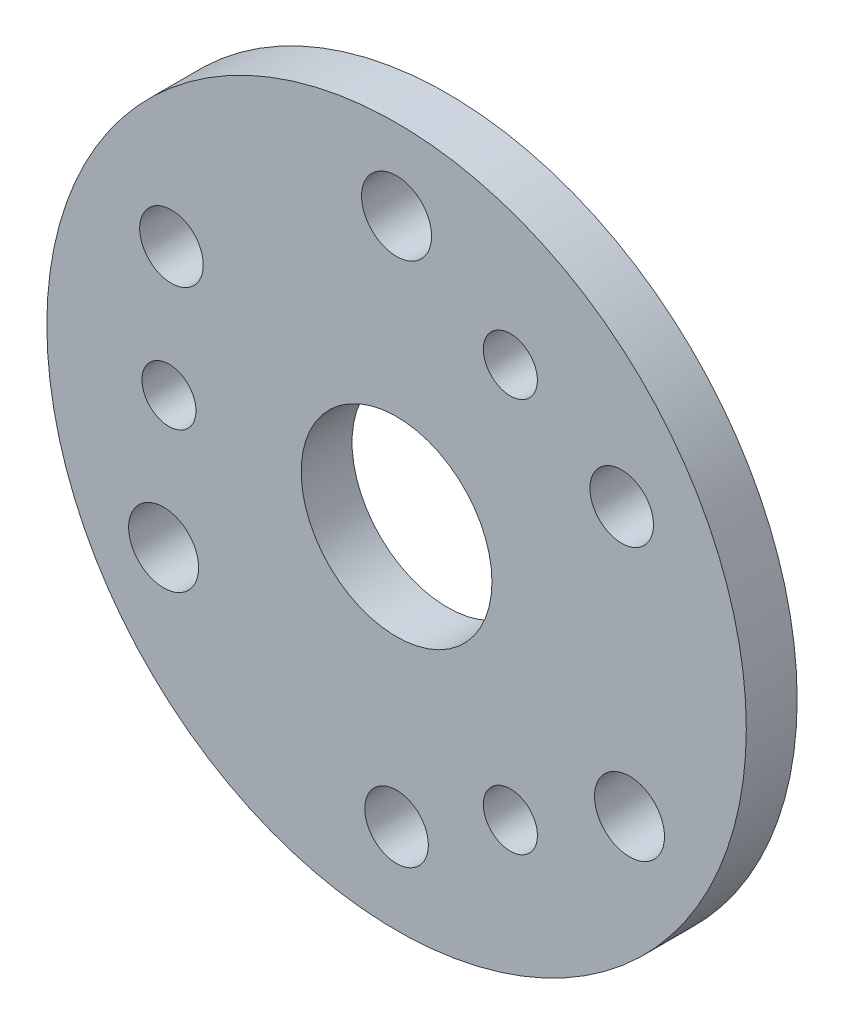
ISO-10303-21;
HEADER;
FILE_DESCRIPTION(('STEP AP214'),'2;1');
FILE_NAME('part.step','',(''),(''),'','','');
FILE_SCHEMA(('AUTOMOTIVE_DESIGN { 1 0 10303 214 1 1 1 1 }'));
ENDSEC;
DATA;
#1=APPLICATION_CONTEXT('core data for automotive mechanical design processes');
#2=APPLICATION_PROTOCOL_DEFINITION('international standard','automotive_design',2000,#1);
#3=PRODUCT_CONTEXT('',#1,'mechanical');
#4=PRODUCT('Part','Part','',(#3));
#5=PRODUCT_RELATED_PRODUCT_CATEGORY('part','',(#4));
#6=PRODUCT_DEFINITION_FORMATION('','',#4);
#7=PRODUCT_DEFINITION_CONTEXT('part definition',#1,'design');
#8=PRODUCT_DEFINITION('design','',#6,#7);
#9=PRODUCT_DEFINITION_SHAPE('','',#8);
#10=(LENGTH_UNIT() NAMED_UNIT(*) SI_UNIT(.MILLI.,.METRE.));
#11=(NAMED_UNIT(*) PLANE_ANGLE_UNIT() SI_UNIT($,.RADIAN.));
#12=(NAMED_UNIT(*) SI_UNIT($,.STERADIAN.) SOLID_ANGLE_UNIT());
#13=UNCERTAINTY_MEASURE_WITH_UNIT(LENGTH_MEASURE(1.E-05),#10,'distance_accuracy_value','');
#14=(GEOMETRIC_REPRESENTATION_CONTEXT(3) GLOBAL_UNCERTAINTY_ASSIGNED_CONTEXT((#13)) GLOBAL_UNIT_ASSIGNED_CONTEXT((#10,
#11,#12)) REPRESENTATION_CONTEXT('',''));
#15=CARTESIAN_POINT('',(0.,0.,0.));
#16=DIRECTION('',(0.,0.,1.));
#17=DIRECTION('',(1.,0.,0.));
#18=AXIS2_PLACEMENT_3D('',#15,#16,#17);
#19=CARTESIAN_POINT('',(0.,0.,8.));
#20=DIRECTION('',(0.,0.,1.));
#21=DIRECTION('',(1.,0.,0.));
#22=AXIS2_PLACEMENT_3D('',#19,#20,#21);
#23=PLANE('',#22);
#24=CARTESIAN_POINT('',(-35.7957166897568,0.,8.));
#25=DIRECTION('',(0.,0.,1.));
#26=DIRECTION('',(1.,0.,0.));
#27=AXIS2_PLACEMENT_3D('',#24,#25,#26);
#28=CIRCLE('',#27,4.25);
#29=CARTESIAN_POINT('',(-31.5457166897568,0.,8.));
#30=VERTEX_POINT('',#29);
#31=EDGE_CURVE('E101',#30,#30,#28,.T.);
#32=ORIENTED_EDGE('',*,*,#31,.F.);
#33=EDGE_LOOP('',(#32));
#34=FACE_BOUND('',#33,.T.);
#35=CARTESIAN_POINT('',(0.,-40.8763990586255,8.));
#36=DIRECTION('',(0.,0.,1.));
#37=DIRECTION('',(1.,0.,0.));
#38=AXIS2_PLACEMENT_3D('',#35,#36,#37);
#39=CIRCLE('',#38,5.);
#40=CARTESIAN_POINT('',(4.99999999999992,-40.8763990586255,8.));
#41=VERTEX_POINT('',#40);
#42=EDGE_CURVE('E89',#41,#41,#39,.T.);
#43=ORIENTED_EDGE('',*,*,#42,.F.);
#44=EDGE_LOOP('',(#43));
#45=FACE_BOUND('',#44,.T.);
#46=CARTESIAN_POINT('',(36.6328745800817,-21.15,8.));
#47=DIRECTION('',(0.,0.,1.));
#48=DIRECTION('',(1.,0.,0.));
#49=AXIS2_PLACEMENT_3D('',#46,#47,#48);
#50=CIRCLE('',#49,5.5);
#51=CARTESIAN_POINT('',(42.1328745800817,-21.15,8.));
#52=VERTEX_POINT('',#51);
#53=EDGE_CURVE('E77',#52,#52,#50,.T.);
#54=ORIENTED_EDGE('',*,*,#53,.F.);
#55=EDGE_LOOP('',(#54));
#56=FACE_BOUND('',#55,.T.);
#57=CARTESIAN_POINT('',(17.8978583448784,31.,8.));
#58=DIRECTION('',(0.,0.,1.));
#59=DIRECTION('',(1.,0.,0.));
#60=AXIS2_PLACEMENT_3D('',#57,#58,#59);
#61=CIRCLE('',#60,4.25);
#62=CARTESIAN_POINT('',(22.1478583448784,31.,8.));
#63=VERTEX_POINT('',#62);
#64=EDGE_CURVE('E65',#63,#63,#61,.T.);
#65=ORIENTED_EDGE('',*,*,#64,.F.);
#66=EDGE_LOOP('',(#65));
#67=FACE_BOUND('',#66,.T.);
#68=CARTESIAN_POINT('',(0.,0.,8.));
#69=DIRECTION('',(0.,0.,1.));
#70=DIRECTION('',(1.,0.,0.));
#71=AXIS2_PLACEMENT_3D('',#68,#69,#70);
#72=CIRCLE('',#71,15.);
#73=CARTESIAN_POINT('',(15.,0.,8.));
#74=VERTEX_POINT('',#73);
#75=EDGE_CURVE('E54',#74,#74,#72,.T.);
#76=ORIENTED_EDGE('',*,*,#75,.F.);
#77=EDGE_LOOP('',(#76));
#78=FACE_BOUND('',#77,.T.);
#79=CARTESIAN_POINT('',(0.,0.,8.));
#80=DIRECTION('',(0.,0.,1.));
#81=DIRECTION('',(1.,0.,0.));
#82=AXIS2_PLACEMENT_3D('',#79,#80,#81);
#83=CIRCLE('',#82,55.);
#84=CARTESIAN_POINT('',(55.,0.,8.));
#85=VERTEX_POINT('',#84);
#86=EDGE_CURVE('E12',#85,#85,#83,.T.);
#87=ORIENTED_EDGE('',*,*,#86,.T.);
#88=EDGE_LOOP('',(#87));
#89=FACE_BOUND('',#88,.T.);
#90=CARTESIAN_POINT('',(0.,42.3,8.));
#91=DIRECTION('',(0.,0.,1.));
#92=DIRECTION('',(1.,0.,0.));
#93=AXIS2_PLACEMENT_3D('',#90,#91,#92);
#94=CIRCLE('',#93,5.5);
#95=CARTESIAN_POINT('',(5.50000000000002,42.3,8.));
#96=VERTEX_POINT('',#95);
#97=EDGE_CURVE('E59',#96,#96,#94,.T.);
#98=ORIENTED_EDGE('',*,*,#97,.F.);
#99=EDGE_LOOP('',(#98));
#100=FACE_BOUND('',#99,.T.);
#101=CARTESIAN_POINT('',(35.4,20.4381995293127,8.));
#102=DIRECTION('',(0.,0.,1.));
#103=DIRECTION('',(1.,0.,0.));
#104=AXIS2_PLACEMENT_3D('',#101,#102,#103);
#105=CIRCLE('',#104,4.99999999999999);
#106=CARTESIAN_POINT('',(40.4,20.4381995293127,8.));
#107=VERTEX_POINT('',#106);
#108=EDGE_CURVE('E71',#107,#107,#105,.T.);
#109=ORIENTED_EDGE('',*,*,#108,.F.);
#110=EDGE_LOOP('',(#109));
#111=FACE_BOUND('',#110,.T.);
#112=CARTESIAN_POINT('',(17.8978583448784,-31.,8.));
#113=DIRECTION('',(0.,0.,1.));
#114=DIRECTION('',(1.,0.,0.));
#115=AXIS2_PLACEMENT_3D('',#112,#113,#114);
#116=CIRCLE('',#115,4.25);
#117=CARTESIAN_POINT('',(22.1478583448784,-31.,8.));
#118=VERTEX_POINT('',#117);
#119=EDGE_CURVE('E83',#118,#118,#116,.T.);
#120=ORIENTED_EDGE('',*,*,#119,.F.);
#121=EDGE_LOOP('',(#120));
#122=FACE_BOUND('',#121,.T.);
#123=CARTESIAN_POINT('',(-36.6328745800817,-21.15,8.));
#124=DIRECTION('',(0.,0.,1.));
#125=DIRECTION('',(1.,0.,0.));
#126=AXIS2_PLACEMENT_3D('',#123,#124,#125);
#127=CIRCLE('',#126,5.5);
#128=CARTESIAN_POINT('',(-31.1328745800817,-21.15,8.));
#129=VERTEX_POINT('',#128);
#130=EDGE_CURVE('E95',#129,#129,#127,.T.);
#131=ORIENTED_EDGE('',*,*,#130,.F.);
#132=EDGE_LOOP('',(#131));
#133=FACE_BOUND('',#132,.T.);
#134=CARTESIAN_POINT('',(-35.4,20.4381995293128,8.));
#135=DIRECTION('',(0.,0.,1.));
#136=DIRECTION('',(1.,0.,0.));
#137=AXIS2_PLACEMENT_3D('',#134,#135,#136);
#138=CIRCLE('',#137,5.);
#139=CARTESIAN_POINT('',(-30.4,20.4381995293128,8.));
#140=VERTEX_POINT('',#139);
#141=EDGE_CURVE('E107',#140,#140,#138,.T.);
#142=ORIENTED_EDGE('',*,*,#141,.F.);
#143=EDGE_LOOP('',(#142));
#144=FACE_BOUND('',#143,.T.);
#145=ADVANCED_FACE('F43',(#34,#45,#56,#67,#78,#89,#100,#111,#122,#133,#144),#23,.T.);
#146=CARTESIAN_POINT('',(0.,0.,0.));
#147=DIRECTION('',(0.,0.,1.));
#148=DIRECTION('',(1.,0.,0.));
#149=AXIS2_PLACEMENT_3D('',#146,#147,#148);
#150=PLANE('',#149);
#151=CARTESIAN_POINT('',(0.,0.,0.));
#152=DIRECTION('',(0.,0.,1.));
#153=DIRECTION('',(1.,0.,0.));
#154=AXIS2_PLACEMENT_3D('',#151,#152,#153);
#155=CIRCLE('',#154,55.);
#156=CARTESIAN_POINT('',(55.,0.,0.));
#157=VERTEX_POINT('',#156);
#158=EDGE_CURVE('E47',#157,#157,#155,.T.);
#159=ORIENTED_EDGE('',*,*,#158,.F.);
#160=EDGE_LOOP('',(#159));
#161=FACE_BOUND('',#160,.T.);
#162=CARTESIAN_POINT('',(0.,0.,0.));
#163=DIRECTION('',(0.,0.,1.));
#164=DIRECTION('',(1.,0.,0.));
#165=AXIS2_PLACEMENT_3D('',#162,#163,#164);
#166=CIRCLE('',#165,15.);
#167=CARTESIAN_POINT('',(15.,0.,0.));
#168=VERTEX_POINT('',#167);
#169=EDGE_CURVE('E56',#168,#168,#166,.T.);
#170=ORIENTED_EDGE('',*,*,#169,.T.);
#171=EDGE_LOOP('',(#170));
#172=FACE_BOUND('',#171,.T.);
#173=CARTESIAN_POINT('',(0.,42.3,0.));
#174=DIRECTION('',(0.,0.,1.));
#175=DIRECTION('',(1.,0.,0.));
#176=AXIS2_PLACEMENT_3D('',#173,#174,#175);
#177=CIRCLE('',#176,5.5);
#178=CARTESIAN_POINT('',(5.50000000000002,42.3,0.));
#179=VERTEX_POINT('',#178);
#180=EDGE_CURVE('E62',#179,#179,#177,.T.);
#181=ORIENTED_EDGE('',*,*,#180,.T.);
#182=EDGE_LOOP('',(#181));
#183=FACE_BOUND('',#182,.T.);
#184=CARTESIAN_POINT('',(17.8978583448784,31.,0.));
#185=DIRECTION('',(0.,0.,1.));
#186=DIRECTION('',(1.,0.,0.));
#187=AXIS2_PLACEMENT_3D('',#184,#185,#186);
#188=CIRCLE('',#187,4.25);
#189=CARTESIAN_POINT('',(22.1478583448784,31.,0.));
#190=VERTEX_POINT('',#189);
#191=EDGE_CURVE('E68',#190,#190,#188,.T.);
#192=ORIENTED_EDGE('',*,*,#191,.T.);
#193=EDGE_LOOP('',(#192));
#194=FACE_BOUND('',#193,.T.);
#195=CARTESIAN_POINT('',(35.4,20.4381995293127,0.));
#196=DIRECTION('',(0.,0.,1.));
#197=DIRECTION('',(1.,0.,0.));
#198=AXIS2_PLACEMENT_3D('',#195,#196,#197);
#199=CIRCLE('',#198,4.99999999999999);
#200=CARTESIAN_POINT('',(40.4,20.4381995293127,0.));
#201=VERTEX_POINT('',#200);
#202=EDGE_CURVE('E74',#201,#201,#199,.T.);
#203=ORIENTED_EDGE('',*,*,#202,.T.);
#204=EDGE_LOOP('',(#203));
#205=FACE_BOUND('',#204,.T.);
#206=CARTESIAN_POINT('',(36.6328745800817,-21.15,0.));
#207=DIRECTION('',(0.,0.,1.));
#208=DIRECTION('',(1.,0.,0.));
#209=AXIS2_PLACEMENT_3D('',#206,#207,#208);
#210=CIRCLE('',#209,5.5);
#211=CARTESIAN_POINT('',(42.1328745800817,-21.15,0.));
#212=VERTEX_POINT('',#211);
#213=EDGE_CURVE('E80',#212,#212,#210,.T.);
#214=ORIENTED_EDGE('',*,*,#213,.T.);
#215=EDGE_LOOP('',(#214));
#216=FACE_BOUND('',#215,.T.);
#217=CARTESIAN_POINT('',(17.8978583448784,-31.,0.));
#218=DIRECTION('',(0.,0.,1.));
#219=DIRECTION('',(1.,0.,0.));
#220=AXIS2_PLACEMENT_3D('',#217,#218,#219);
#221=CIRCLE('',#220,4.25);
#222=CARTESIAN_POINT('',(22.1478583448784,-31.,0.));
#223=VERTEX_POINT('',#222);
#224=EDGE_CURVE('E86',#223,#223,#221,.T.);
#225=ORIENTED_EDGE('',*,*,#224,.T.);
#226=EDGE_LOOP('',(#225));
#227=FACE_BOUND('',#226,.T.);
#228=CARTESIAN_POINT('',(0.,-40.8763990586255,0.));
#229=DIRECTION('',(0.,0.,1.));
#230=DIRECTION('',(1.,0.,0.));
#231=AXIS2_PLACEMENT_3D('',#228,#229,#230);
#232=CIRCLE('',#231,5.);
#233=CARTESIAN_POINT('',(4.99999999999992,-40.8763990586255,0.));
#234=VERTEX_POINT('',#233);
#235=EDGE_CURVE('E92',#234,#234,#232,.T.);
#236=ORIENTED_EDGE('',*,*,#235,.T.);
#237=EDGE_LOOP('',(#236));
#238=FACE_BOUND('',#237,.T.);
#239=CARTESIAN_POINT('',(-36.6328745800817,-21.15,0.));
#240=DIRECTION('',(0.,0.,1.));
#241=DIRECTION('',(1.,0.,0.));
#242=AXIS2_PLACEMENT_3D('',#239,#240,#241);
#243=CIRCLE('',#242,5.5);
#244=CARTESIAN_POINT('',(-31.1328745800817,-21.15,0.));
#245=VERTEX_POINT('',#244);
#246=EDGE_CURVE('E98',#245,#245,#243,.T.);
#247=ORIENTED_EDGE('',*,*,#246,.T.);
#248=EDGE_LOOP('',(#247));
#249=FACE_BOUND('',#248,.T.);
#250=CARTESIAN_POINT('',(-35.7957166897568,0.,0.));
#251=DIRECTION('',(0.,0.,1.));
#252=DIRECTION('',(1.,0.,0.));
#253=AXIS2_PLACEMENT_3D('',#250,#251,#252);
#254=CIRCLE('',#253,4.25);
#255=CARTESIAN_POINT('',(-31.5457166897568,0.,0.));
#256=VERTEX_POINT('',#255);
#257=EDGE_CURVE('E104',#256,#256,#254,.T.);
#258=ORIENTED_EDGE('',*,*,#257,.T.);
#259=EDGE_LOOP('',(#258));
#260=FACE_BOUND('',#259,.T.);
#261=CARTESIAN_POINT('',(-35.4,20.4381995293128,0.));
#262=DIRECTION('',(0.,0.,1.));
#263=DIRECTION('',(1.,0.,0.));
#264=AXIS2_PLACEMENT_3D('',#261,#262,#263);
#265=CIRCLE('',#264,5.);
#266=CARTESIAN_POINT('',(-30.4,20.4381995293128,0.));
#267=VERTEX_POINT('',#266);
#268=EDGE_CURVE('E110',#267,#267,#265,.T.);
#269=ORIENTED_EDGE('',*,*,#268,.T.);
#270=EDGE_LOOP('',(#269));
#271=FACE_BOUND('',#270,.T.);
#272=ADVANCED_FACE('F120',(#161,#172,#183,#194,#205,#216,#227,#238,#249,#260,#271),#150,.F.);
#273=CARTESIAN_POINT('',(0.,0.,8.));
#274=DIRECTION('',(0.,0.,-1.));
#275=DIRECTION('',(-1.,0.,0.));
#276=AXIS2_PLACEMENT_3D('',#273,#274,#275);
#277=CYLINDRICAL_SURFACE('',#276,55.);
#278=ORIENTED_EDGE('',*,*,#86,.F.);
#279=EDGE_LOOP('',(#278));
#280=FACE_BOUND('',#279,.T.);
#281=ORIENTED_EDGE('',*,*,#158,.T.);
#282=EDGE_LOOP('',(#281));
#283=FACE_BOUND('',#282,.T.);
#284=ADVANCED_FACE('F45',(#280,#283),#277,.T.);
#285=CARTESIAN_POINT('',(0.,0.,8.));
#286=DIRECTION('',(0.,0.,-1.));
#287=DIRECTION('',(-1.,0.,0.));
#288=AXIS2_PLACEMENT_3D('',#285,#286,#287);
#289=CYLINDRICAL_SURFACE('',#288,15.);
#290=ORIENTED_EDGE('',*,*,#75,.T.);
#291=EDGE_LOOP('',(#290));
#292=FACE_BOUND('',#291,.T.);
#293=ORIENTED_EDGE('',*,*,#169,.F.);
#294=EDGE_LOOP('',(#293));
#295=FACE_BOUND('',#294,.T.);
#296=ADVANCED_FACE('F130',(#292,#295),#289,.F.);
#297=CARTESIAN_POINT('',(0.,42.3,8.));
#298=DIRECTION('',(0.,0.,-1.));
#299=DIRECTION('',(-1.,0.,0.));
#300=AXIS2_PLACEMENT_3D('',#297,#298,#299);
#301=CYLINDRICAL_SURFACE('',#300,5.5);
#302=ORIENTED_EDGE('',*,*,#97,.T.);
#303=EDGE_LOOP('',(#302));
#304=FACE_BOUND('',#303,.T.);
#305=ORIENTED_EDGE('',*,*,#180,.F.);
#306=EDGE_LOOP('',(#305));
#307=FACE_BOUND('',#306,.T.);
#308=ADVANCED_FACE('F133',(#304,#307),#301,.F.);
#309=CARTESIAN_POINT('',(17.8978583448784,31.,8.));
#310=DIRECTION('',(0.,0.,-1.));
#311=DIRECTION('',(-1.,0.,0.));
#312=AXIS2_PLACEMENT_3D('',#309,#310,#311);
#313=CYLINDRICAL_SURFACE('',#312,4.25);
#314=ORIENTED_EDGE('',*,*,#64,.T.);
#315=EDGE_LOOP('',(#314));
#316=FACE_BOUND('',#315,.T.);
#317=ORIENTED_EDGE('',*,*,#191,.F.);
#318=EDGE_LOOP('',(#317));
#319=FACE_BOUND('',#318,.T.);
#320=ADVANCED_FACE('F137',(#316,#319),#313,.F.);
#321=CARTESIAN_POINT('',(35.4,20.4381995293127,8.));
#322=DIRECTION('',(0.,0.,-1.));
#323=DIRECTION('',(-1.,0.,0.));
#324=AXIS2_PLACEMENT_3D('',#321,#322,#323);
#325=CYLINDRICAL_SURFACE('',#324,4.99999999999999);
#326=ORIENTED_EDGE('',*,*,#108,.T.);
#327=EDGE_LOOP('',(#326));
#328=FACE_BOUND('',#327,.T.);
#329=ORIENTED_EDGE('',*,*,#202,.F.);
#330=EDGE_LOOP('',(#329));
#331=FACE_BOUND('',#330,.T.);
#332=ADVANCED_FACE('F141',(#328,#331),#325,.F.);
#333=CARTESIAN_POINT('',(36.6328745800817,-21.15,8.));
#334=DIRECTION('',(0.,0.,-1.));
#335=DIRECTION('',(-1.,0.,0.));
#336=AXIS2_PLACEMENT_3D('',#333,#334,#335);
#337=CYLINDRICAL_SURFACE('',#336,5.5);
#338=ORIENTED_EDGE('',*,*,#53,.T.);
#339=EDGE_LOOP('',(#338));
#340=FACE_BOUND('',#339,.T.);
#341=ORIENTED_EDGE('',*,*,#213,.F.);
#342=EDGE_LOOP('',(#341));
#343=FACE_BOUND('',#342,.T.);
#344=ADVANCED_FACE('F145',(#340,#343),#337,.F.);
#345=CARTESIAN_POINT('',(17.8978583448784,-31.,8.));
#346=DIRECTION('',(0.,0.,-1.));
#347=DIRECTION('',(-1.,0.,0.));
#348=AXIS2_PLACEMENT_3D('',#345,#346,#347);
#349=CYLINDRICAL_SURFACE('',#348,4.25);
#350=ORIENTED_EDGE('',*,*,#119,.T.);
#351=EDGE_LOOP('',(#350));
#352=FACE_BOUND('',#351,.T.);
#353=ORIENTED_EDGE('',*,*,#224,.F.);
#354=EDGE_LOOP('',(#353));
#355=FACE_BOUND('',#354,.T.);
#356=ADVANCED_FACE('F149',(#352,#355),#349,.F.);
#357=CARTESIAN_POINT('',(0.,-40.8763990586255,8.));
#358=DIRECTION('',(0.,0.,-1.));
#359=DIRECTION('',(-1.,0.,0.));
#360=AXIS2_PLACEMENT_3D('',#357,#358,#359);
#361=CYLINDRICAL_SURFACE('',#360,5.);
#362=ORIENTED_EDGE('',*,*,#42,.T.);
#363=EDGE_LOOP('',(#362));
#364=FACE_BOUND('',#363,.T.);
#365=ORIENTED_EDGE('',*,*,#235,.F.);
#366=EDGE_LOOP('',(#365));
#367=FACE_BOUND('',#366,.T.);
#368=ADVANCED_FACE('F153',(#364,#367),#361,.F.);
#369=CARTESIAN_POINT('',(-36.6328745800817,-21.15,8.));
#370=DIRECTION('',(0.,0.,-1.));
#371=DIRECTION('',(-1.,0.,0.));
#372=AXIS2_PLACEMENT_3D('',#369,#370,#371);
#373=CYLINDRICAL_SURFACE('',#372,5.5);
#374=ORIENTED_EDGE('',*,*,#130,.T.);
#375=EDGE_LOOP('',(#374));
#376=FACE_BOUND('',#375,.T.);
#377=ORIENTED_EDGE('',*,*,#246,.F.);
#378=EDGE_LOOP('',(#377));
#379=FACE_BOUND('',#378,.T.);
#380=ADVANCED_FACE('F157',(#376,#379),#373,.F.);
#381=CARTESIAN_POINT('',(-35.7957166897568,0.,8.));
#382=DIRECTION('',(0.,0.,-1.));
#383=DIRECTION('',(-1.,0.,0.));
#384=AXIS2_PLACEMENT_3D('',#381,#382,#383);
#385=CYLINDRICAL_SURFACE('',#384,4.25);
#386=ORIENTED_EDGE('',*,*,#31,.T.);
#387=EDGE_LOOP('',(#386));
#388=FACE_BOUND('',#387,.T.);
#389=ORIENTED_EDGE('',*,*,#257,.F.);
#390=EDGE_LOOP('',(#389));
#391=FACE_BOUND('',#390,.T.);
#392=ADVANCED_FACE('F161',(#388,#391),#385,.F.);
#393=CARTESIAN_POINT('',(-35.4,20.4381995293128,8.));
#394=DIRECTION('',(0.,0.,-1.));
#395=DIRECTION('',(-1.,0.,0.));
#396=AXIS2_PLACEMENT_3D('',#393,#394,#395);
#397=CYLINDRICAL_SURFACE('',#396,5.);
#398=ORIENTED_EDGE('',*,*,#141,.T.);
#399=EDGE_LOOP('',(#398));
#400=FACE_BOUND('',#399,.T.);
#401=ORIENTED_EDGE('',*,*,#268,.F.);
#402=EDGE_LOOP('',(#401));
#403=FACE_BOUND('',#402,.T.);
#404=ADVANCED_FACE('F116',(#400,#403),#397,.F.);
#405=CLOSED_SHELL('',(#145,#272,#284,#296,#308,#320,#332,#344,#356,#368,#380,#392,#404));
#406=MANIFOLD_SOLID_BREP('B2',#405);
#407=ADVANCED_BREP_SHAPE_REPRESENTATION('',(#18,#406),#14);
#408=SHAPE_DEFINITION_REPRESENTATION(#9,#407);
ENDSEC;
END-ISO-10303-21;
